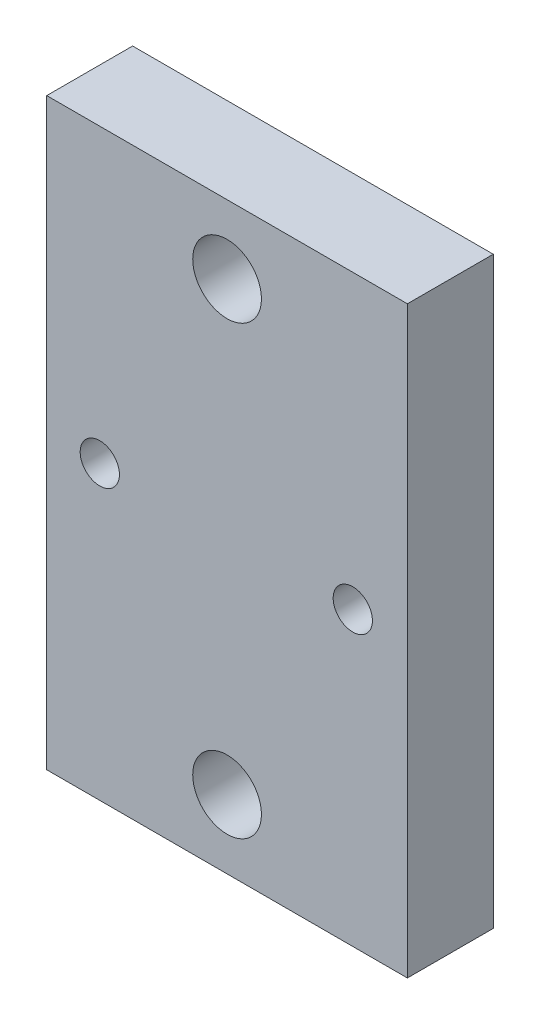
ISO-10303-21;
HEADER;
FILE_DESCRIPTION(('STEP AP214'),'2;1');
FILE_NAME('part.step','',(''),(''),'','','');
FILE_SCHEMA(('AUTOMOTIVE_DESIGN { 1 0 10303 214 1 1 1 1 }'));
ENDSEC;
DATA;
#1=APPLICATION_CONTEXT('core data for automotive mechanical design processes');
#2=APPLICATION_PROTOCOL_DEFINITION('international standard','automotive_design',2000,#1);
#3=PRODUCT_CONTEXT('',#1,'mechanical');
#4=PRODUCT('Part','Part','',(#3));
#5=PRODUCT_RELATED_PRODUCT_CATEGORY('part','',(#4));
#6=PRODUCT_DEFINITION_FORMATION('','',#4);
#7=PRODUCT_DEFINITION_CONTEXT('part definition',#1,'design');
#8=PRODUCT_DEFINITION('design','',#6,#7);
#9=PRODUCT_DEFINITION_SHAPE('','',#8);
#10=(LENGTH_UNIT() NAMED_UNIT(*) SI_UNIT(.MILLI.,.METRE.));
#11=(NAMED_UNIT(*) PLANE_ANGLE_UNIT() SI_UNIT($,.RADIAN.));
#12=(NAMED_UNIT(*) SI_UNIT($,.STERADIAN.) SOLID_ANGLE_UNIT());
#13=UNCERTAINTY_MEASURE_WITH_UNIT(LENGTH_MEASURE(1.E-05),#10,'distance_accuracy_value','');
#14=(GEOMETRIC_REPRESENTATION_CONTEXT(3) GLOBAL_UNCERTAINTY_ASSIGNED_CONTEXT((#13)) GLOBAL_UNIT_ASSIGNED_CONTEXT((#10,
#11,#12)) REPRESENTATION_CONTEXT('',''));
#15=CARTESIAN_POINT('',(0.,0.,0.));
#16=DIRECTION('',(0.,0.,1.));
#17=DIRECTION('',(1.,0.,0.));
#18=AXIS2_PLACEMENT_3D('',#15,#16,#17);
#19=CARTESIAN_POINT('',(-10.5,17.,5.));
#20=DIRECTION('',(1.,0.,0.));
#21=DIRECTION('',(0.,1.,0.));
#22=AXIS2_PLACEMENT_3D('',#19,#20,#21);
#23=PLANE('',#22);
#24=DIRECTION('',(0.,-1.,0.));
#25=VECTOR('',#24,1.);
#26=CARTESIAN_POINT('',(-10.5,17.,0.));
#27=LINE('',#26,#25);
#28=CARTESIAN_POINT('',(-10.5,17.,0.));
#29=VERTEX_POINT('',#28);
#30=CARTESIAN_POINT('',(-10.5,-17.,0.));
#31=VERTEX_POINT('',#30);
#32=EDGE_CURVE('E95',#29,#31,#27,.T.);
#33=ORIENTED_EDGE('',*,*,#32,.T.);
#34=DIRECTION('',(0.,0.,-1.));
#35=VECTOR('',#34,1.);
#36=CARTESIAN_POINT('',(-10.5,-17.,5.));
#37=LINE('',#36,#35);
#38=CARTESIAN_POINT('',(-10.5,-17.,5.));
#39=VERTEX_POINT('',#38);
#40=EDGE_CURVE('E11',#39,#31,#37,.T.);
#41=ORIENTED_EDGE('',*,*,#40,.F.);
#42=DIRECTION('',(0.,-1.,0.));
#43=VECTOR('',#42,1.);
#44=CARTESIAN_POINT('',(-10.5,17.,5.));
#45=LINE('',#44,#43);
#46=CARTESIAN_POINT('',(-10.5,17.,5.));
#47=VERTEX_POINT('',#46);
#48=EDGE_CURVE('E83',#47,#39,#45,.T.);
#49=ORIENTED_EDGE('',*,*,#48,.F.);
#50=DIRECTION('',(0.,0.,-1.));
#51=VECTOR('',#50,1.);
#52=CARTESIAN_POINT('',(-10.5,17.,5.));
#53=LINE('',#52,#51);
#54=EDGE_CURVE('E91',#47,#29,#53,.T.);
#55=ORIENTED_EDGE('',*,*,#54,.T.);
#56=EDGE_LOOP('',(#33,#41,#49,#55));
#57=FACE_BOUND('',#56,.T.);
#58=ADVANCED_FACE('F32',(#57),#23,.F.);
#59=CARTESIAN_POINT('',(-10.5,-17.,5.));
#60=DIRECTION('',(0.,1.,0.));
#61=DIRECTION('',(0.,0.,1.));
#62=AXIS2_PLACEMENT_3D('',#59,#60,#61);
#63=PLANE('',#62);
#64=DIRECTION('',(1.,0.,0.));
#65=VECTOR('',#64,1.);
#66=CARTESIAN_POINT('',(-10.5,-17.,0.));
#67=LINE('',#66,#65);
#68=CARTESIAN_POINT('',(10.5,-17.,0.));
#69=VERTEX_POINT('',#68);
#70=EDGE_CURVE('E87',#31,#69,#67,.T.);
#71=ORIENTED_EDGE('',*,*,#70,.T.);
#72=DIRECTION('',(0.,0.,-1.));
#73=VECTOR('',#72,1.);
#74=CARTESIAN_POINT('',(10.5,-17.,5.));
#75=LINE('',#74,#73);
#76=CARTESIAN_POINT('',(10.5,-17.,5.));
#77=VERTEX_POINT('',#76);
#78=EDGE_CURVE('E40',#77,#69,#75,.T.);
#79=ORIENTED_EDGE('',*,*,#78,.F.);
#80=DIRECTION('',(1.,0.,0.));
#81=VECTOR('',#80,1.);
#82=CARTESIAN_POINT('',(-10.5,-17.,5.));
#83=LINE('',#82,#81);
#84=EDGE_CURVE('E78',#39,#77,#83,.T.);
#85=ORIENTED_EDGE('',*,*,#84,.F.);
#86=ORIENTED_EDGE('',*,*,#40,.T.);
#87=EDGE_LOOP('',(#71,#79,#85,#86));
#88=FACE_BOUND('',#87,.T.);
#89=ADVANCED_FACE('F86',(#88),#63,.F.);
#90=CARTESIAN_POINT('',(10.5,17.,5.));
#91=DIRECTION('',(-1.,0.,0.));
#92=DIRECTION('',(0.,-1.,0.));
#93=AXIS2_PLACEMENT_3D('',#90,#91,#92);
#94=PLANE('',#93);
#95=DIRECTION('',(0.,1.,0.));
#96=VECTOR('',#95,1.);
#97=CARTESIAN_POINT('',(10.5,17.,0.));
#98=LINE('',#97,#96);
#99=CARTESIAN_POINT('',(10.5,17.,0.));
#100=VERTEX_POINT('',#99);
#101=EDGE_CURVE('E65',#69,#100,#98,.T.);
#102=ORIENTED_EDGE('',*,*,#101,.T.);
#103=DIRECTION('',(0.,0.,-1.));
#104=VECTOR('',#103,1.);
#105=CARTESIAN_POINT('',(10.5,17.,5.));
#106=LINE('',#105,#104);
#107=CARTESIAN_POINT('',(10.5,17.,5.));
#108=VERTEX_POINT('',#107);
#109=EDGE_CURVE('E88',#108,#100,#106,.T.);
#110=ORIENTED_EDGE('',*,*,#109,.F.);
#111=DIRECTION('',(0.,1.,0.));
#112=VECTOR('',#111,1.);
#113=CARTESIAN_POINT('',(10.5,17.,5.));
#114=LINE('',#113,#112);
#115=EDGE_CURVE('E81',#77,#108,#114,.T.);
#116=ORIENTED_EDGE('',*,*,#115,.F.);
#117=ORIENTED_EDGE('',*,*,#78,.T.);
#118=EDGE_LOOP('',(#102,#110,#116,#117));
#119=FACE_BOUND('',#118,.T.);
#120=ADVANCED_FACE('F89',(#119),#94,.F.);
#121=CARTESIAN_POINT('',(-10.5,17.,5.));
#122=DIRECTION('',(0.,-1.,0.));
#123=DIRECTION('',(1.,0.,0.));
#124=AXIS2_PLACEMENT_3D('',#121,#122,#123);
#125=PLANE('',#124);
#126=DIRECTION('',(-1.,0.,0.));
#127=VECTOR('',#126,1.);
#128=CARTESIAN_POINT('',(-10.5,17.,0.));
#129=LINE('',#128,#127);
#130=EDGE_CURVE('E71',#100,#29,#129,.T.);
#131=ORIENTED_EDGE('',*,*,#130,.T.);
#132=ORIENTED_EDGE('',*,*,#54,.F.);
#133=DIRECTION('',(-1.,0.,0.));
#134=VECTOR('',#133,1.);
#135=CARTESIAN_POINT('',(-10.5,17.,5.));
#136=LINE('',#135,#134);
#137=EDGE_CURVE('E48',#108,#47,#136,.T.);
#138=ORIENTED_EDGE('',*,*,#137,.F.);
#139=ORIENTED_EDGE('',*,*,#109,.T.);
#140=EDGE_LOOP('',(#131,#132,#138,#139));
#141=FACE_BOUND('',#140,.T.);
#142=ADVANCED_FACE('F103',(#141),#125,.F.);
#143=CARTESIAN_POINT('',(0.,0.,5.));
#144=DIRECTION('',(0.,0.,1.));
#145=DIRECTION('',(1.,0.,0.));
#146=AXIS2_PLACEMENT_3D('',#143,#144,#145);
#147=PLANE('',#146);
#148=CARTESIAN_POINT('',(0.,-12.9999999999999,5.));
#149=DIRECTION('',(0.,0.,1.));
#150=DIRECTION('',(1.,0.,0.));
#151=AXIS2_PLACEMENT_3D('',#148,#149,#150);
#152=CIRCLE('',#151,2.);
#153=CARTESIAN_POINT('',(2.00000000000001,-12.9999999999999,5.));
#154=VERTEX_POINT('',#153);
#155=EDGE_CURVE('E118',#154,#154,#152,.T.);
#156=ORIENTED_EDGE('',*,*,#155,.F.);
#157=EDGE_LOOP('',(#156));
#158=FACE_BOUND('',#157,.T.);
#159=CARTESIAN_POINT('',(0.,13.0000000000001,5.));
#160=DIRECTION('',(0.,0.,1.));
#161=DIRECTION('',(1.,0.,0.));
#162=AXIS2_PLACEMENT_3D('',#159,#160,#161);
#163=CIRCLE('',#162,2.);
#164=CARTESIAN_POINT('',(1.99999999999999,13.0000000000001,5.));
#165=VERTEX_POINT('',#164);
#166=EDGE_CURVE('E123',#165,#165,#163,.T.);
#167=ORIENTED_EDGE('',*,*,#166,.F.);
#168=EDGE_LOOP('',(#167));
#169=FACE_BOUND('',#168,.T.);
#170=CARTESIAN_POINT('',(-7.41150993430774,-1.71777895672646E-13,5.));
#171=DIRECTION('',(0.,0.,1.));
#172=DIRECTION('',(1.,0.,0.));
#173=AXIS2_PLACEMENT_3D('',#170,#171,#172);
#174=CIRCLE('',#173,1.14300000000003);
#175=CARTESIAN_POINT('',(-6.26850993430772,-1.71777895672646E-13,5.));
#176=VERTEX_POINT('',#175);
#177=EDGE_CURVE('E98',#176,#176,#174,.T.);
#178=ORIENTED_EDGE('',*,*,#177,.F.);
#179=EDGE_LOOP('',(#178));
#180=FACE_BOUND('',#179,.T.);
#181=CARTESIAN_POINT('',(7.32049006569226,0.,5.));
#182=DIRECTION('',(0.,0.,1.));
#183=DIRECTION('',(1.,0.,0.));
#184=AXIS2_PLACEMENT_3D('',#181,#182,#183);
#185=CIRCLE('',#184,1.14299999999998);
#186=CARTESIAN_POINT('',(8.46349006569223,0.,5.));
#187=VERTEX_POINT('',#186);
#188=EDGE_CURVE('E111',#187,#187,#185,.T.);
#189=ORIENTED_EDGE('',*,*,#188,.F.);
#190=EDGE_LOOP('',(#189));
#191=FACE_BOUND('',#190,.T.);
#192=ORIENTED_EDGE('',*,*,#48,.T.);
#193=ORIENTED_EDGE('',*,*,#84,.T.);
#194=ORIENTED_EDGE('',*,*,#115,.T.);
#195=ORIENTED_EDGE('',*,*,#137,.T.);
#196=EDGE_LOOP('',(#192,#193,#194,#195));
#197=FACE_BOUND('',#196,.T.);
#198=ADVANCED_FACE('F79',(#158,#169,#180,#191,#197),#147,.T.);
#199=CARTESIAN_POINT('',(0.,0.,0.));
#200=DIRECTION('',(0.,0.,1.));
#201=DIRECTION('',(1.,0.,0.));
#202=AXIS2_PLACEMENT_3D('',#199,#200,#201);
#203=PLANE('',#202);
#204=CARTESIAN_POINT('',(0.,-12.9999999999999,0.));
#205=DIRECTION('',(0.,0.,-1.));
#206=DIRECTION('',(-1.,0.,0.));
#207=AXIS2_PLACEMENT_3D('',#204,#205,#206);
#208=CIRCLE('',#207,2.);
#209=CARTESIAN_POINT('',(-1.99999999999999,-12.9999999999999,0.));
#210=VERTEX_POINT('',#209);
#211=EDGE_CURVE('E126',#210,#210,#208,.T.);
#212=ORIENTED_EDGE('',*,*,#211,.F.);
#213=EDGE_LOOP('',(#212));
#214=FACE_BOUND('',#213,.T.);
#215=CARTESIAN_POINT('',(0.,13.0000000000001,0.));
#216=DIRECTION('',(0.,0.,-1.));
#217=DIRECTION('',(-1.,0.,0.));
#218=AXIS2_PLACEMENT_3D('',#215,#216,#217);
#219=CIRCLE('',#218,2.);
#220=CARTESIAN_POINT('',(-2.00000000000001,13.0000000000001,0.));
#221=VERTEX_POINT('',#220);
#222=EDGE_CURVE('E127',#221,#221,#219,.T.);
#223=ORIENTED_EDGE('',*,*,#222,.F.);
#224=EDGE_LOOP('',(#223));
#225=FACE_BOUND('',#224,.T.);
#226=CARTESIAN_POINT('',(-7.41150993430774,-1.71777895672646E-13,0.));
#227=DIRECTION('',(0.,0.,-1.));
#228=DIRECTION('',(-1.,0.,0.));
#229=AXIS2_PLACEMENT_3D('',#226,#227,#228);
#230=CIRCLE('',#229,1.14300000000003);
#231=CARTESIAN_POINT('',(-8.55450993430777,-1.71777895672646E-13,0.));
#232=VERTEX_POINT('',#231);
#233=EDGE_CURVE('E114',#232,#232,#230,.T.);
#234=ORIENTED_EDGE('',*,*,#233,.F.);
#235=EDGE_LOOP('',(#234));
#236=FACE_BOUND('',#235,.T.);
#237=CARTESIAN_POINT('',(7.32049006569226,0.,0.));
#238=DIRECTION('',(0.,0.,-1.));
#239=DIRECTION('',(-1.,0.,0.));
#240=AXIS2_PLACEMENT_3D('',#237,#238,#239);
#241=CIRCLE('',#240,1.14299999999998);
#242=CARTESIAN_POINT('',(6.17749006569228,0.,0.));
#243=VERTEX_POINT('',#242);
#244=EDGE_CURVE('E115',#243,#243,#241,.T.);
#245=ORIENTED_EDGE('',*,*,#244,.F.);
#246=EDGE_LOOP('',(#245));
#247=FACE_BOUND('',#246,.T.);
#248=ORIENTED_EDGE('',*,*,#32,.F.);
#249=ORIENTED_EDGE('',*,*,#130,.F.);
#250=ORIENTED_EDGE('',*,*,#101,.F.);
#251=ORIENTED_EDGE('',*,*,#70,.F.);
#252=EDGE_LOOP('',(#248,#249,#250,#251));
#253=FACE_BOUND('',#252,.T.);
#254=ADVANCED_FACE('F106',(#214,#225,#236,#247,#253),#203,.F.);
#255=CARTESIAN_POINT('',(7.32049006569226,0.,10.));
#256=DIRECTION('',(0.,0.,-1.));
#257=DIRECTION('',(-1.,0.,0.));
#258=AXIS2_PLACEMENT_3D('',#255,#256,#257);
#259=CYLINDRICAL_SURFACE('',#258,1.14299999999998);
#260=ORIENTED_EDGE('',*,*,#188,.T.);
#261=EDGE_LOOP('',(#260));
#262=FACE_BOUND('',#261,.T.);
#263=ORIENTED_EDGE('',*,*,#244,.T.);
#264=EDGE_LOOP('',(#263));
#265=FACE_BOUND('',#264,.T.);
#266=ADVANCED_FACE('F137',(#262,#265),#259,.F.);
#267=CARTESIAN_POINT('',(-7.41150993430774,-1.71777895672646E-13,10.));
#268=DIRECTION('',(0.,0.,-1.));
#269=DIRECTION('',(-1.,0.,0.));
#270=AXIS2_PLACEMENT_3D('',#267,#268,#269);
#271=CYLINDRICAL_SURFACE('',#270,1.14300000000003);
#272=ORIENTED_EDGE('',*,*,#177,.T.);
#273=EDGE_LOOP('',(#272));
#274=FACE_BOUND('',#273,.T.);
#275=ORIENTED_EDGE('',*,*,#233,.T.);
#276=EDGE_LOOP('',(#275));
#277=FACE_BOUND('',#276,.T.);
#278=ADVANCED_FACE('F146',(#274,#277),#271,.F.);
#279=CARTESIAN_POINT('',(0.,13.0000000000001,10.));
#280=DIRECTION('',(0.,0.,-1.));
#281=DIRECTION('',(-1.,0.,0.));
#282=AXIS2_PLACEMENT_3D('',#279,#280,#281);
#283=CYLINDRICAL_SURFACE('',#282,2.);
#284=ORIENTED_EDGE('',*,*,#166,.T.);
#285=EDGE_LOOP('',(#284));
#286=FACE_BOUND('',#285,.T.);
#287=ORIENTED_EDGE('',*,*,#222,.T.);
#288=EDGE_LOOP('',(#287));
#289=FACE_BOUND('',#288,.T.);
#290=ADVANCED_FACE('F152',(#286,#289),#283,.F.);
#291=CARTESIAN_POINT('',(0.,-12.9999999999999,10.));
#292=DIRECTION('',(0.,0.,-1.));
#293=DIRECTION('',(-1.,0.,0.));
#294=AXIS2_PLACEMENT_3D('',#291,#292,#293);
#295=CYLINDRICAL_SURFACE('',#294,2.);
#296=ORIENTED_EDGE('',*,*,#155,.T.);
#297=EDGE_LOOP('',(#296));
#298=FACE_BOUND('',#297,.T.);
#299=ORIENTED_EDGE('',*,*,#211,.T.);
#300=EDGE_LOOP('',(#299));
#301=FACE_BOUND('',#300,.T.);
#302=ADVANCED_FACE('F133',(#298,#301),#295,.F.);
#303=CLOSED_SHELL('',(#58,#89,#120,#142,#198,#254,#266,#278,#290,#302));
#304=MANIFOLD_SOLID_BREP('B2',#303);
#305=ADVANCED_BREP_SHAPE_REPRESENTATION('',(#18,#304),#14);
#306=SHAPE_DEFINITION_REPRESENTATION(#9,#305);
ENDSEC;
END-ISO-10303-21;
